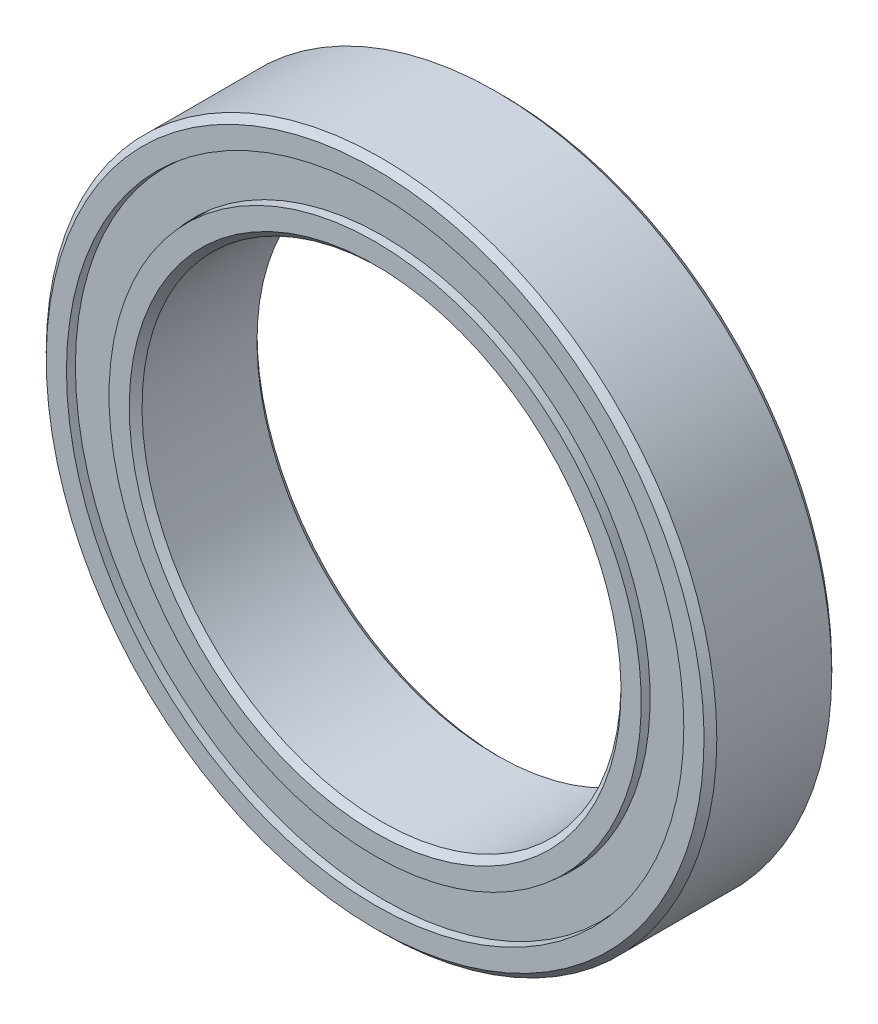
ISO-10303-21;
HEADER;
FILE_DESCRIPTION(('STEP AP214'),'2;1');
FILE_NAME('part.step','',(''),(''),'','','');
FILE_SCHEMA(('AUTOMOTIVE_DESIGN { 1 0 10303 214 1 1 1 1 }'));
ENDSEC;
DATA;
#1=APPLICATION_CONTEXT('core data for automotive mechanical design processes');
#2=APPLICATION_PROTOCOL_DEFINITION('international standard','automotive_design',2000,#1);
#3=PRODUCT_CONTEXT('',#1,'mechanical');
#4=PRODUCT('Part','Part','',(#3));
#5=PRODUCT_RELATED_PRODUCT_CATEGORY('part','',(#4));
#6=PRODUCT_DEFINITION_FORMATION('','',#4);
#7=PRODUCT_DEFINITION_CONTEXT('part definition',#1,'design');
#8=PRODUCT_DEFINITION('design','',#6,#7);
#9=PRODUCT_DEFINITION_SHAPE('','',#8);
#10=(LENGTH_UNIT() NAMED_UNIT(*) SI_UNIT(.MILLI.,.METRE.));
#11=(NAMED_UNIT(*) PLANE_ANGLE_UNIT() SI_UNIT($,.RADIAN.));
#12=(NAMED_UNIT(*) SI_UNIT($,.STERADIAN.) SOLID_ANGLE_UNIT());
#13=UNCERTAINTY_MEASURE_WITH_UNIT(LENGTH_MEASURE(1.E-05),#10,'distance_accuracy_value','');
#14=(GEOMETRIC_REPRESENTATION_CONTEXT(3) GLOBAL_UNCERTAINTY_ASSIGNED_CONTEXT((#13)) GLOBAL_UNIT_ASSIGNED_CONTEXT((#10,
#11,#12)) REPRESENTATION_CONTEXT('',''));
#15=CARTESIAN_POINT('',(0.,0.,0.));
#16=DIRECTION('',(0.,0.,1.));
#17=DIRECTION('',(1.,0.,0.));
#18=AXIS2_PLACEMENT_3D('',#15,#16,#17);
#19=CARTESIAN_POINT('',(3.90495365205792,8.10871981112182,0.));
#20=DIRECTION('',(0.,0.,1.));
#21=DIRECTION('',(0.433883739117546,0.900968867902425,0.));
#22=AXIS2_PLACEMENT_3D('',#19,#20,#21);
#23=SPHERICAL_SURFACE('',#22,1.11111111111111);
#24=CARTESIAN_POINT('',(3.90495365205792,8.10871981112182,1.11111111111111));
#25=VERTEX_POINT('',#24);
#26=VERTEX_LOOP('',#25);
#27=FACE_BOUND('',#26,.T.);
#28=ADVANCED_FACE('F42',(#27),#23,.T.);
#29=CLOSED_SHELL('',(#28));
#30=MANIFOLD_SOLID_BREP('B2',#29);
#31=CARTESIAN_POINT('',(7.0364833422122,5.61140821672869,0.));
#32=DIRECTION('',(0.,0.,1.));
#33=DIRECTION('',(0.781831482468022,0.623489801858743,0.));
#34=AXIS2_PLACEMENT_3D('',#31,#32,#33);
#35=SPHERICAL_SURFACE('',#34,1.11111111111111);
#36=CARTESIAN_POINT('',(7.0364833422122,5.61140821672869,1.11111111111111));
#37=VERTEX_POINT('',#36);
#38=VERTEX_LOOP('',#37);
#39=FACE_BOUND('',#38,.T.);
#40=ADVANCED_FACE('F63',(#39),#35,.T.);
#41=CLOSED_SHELL('',(#40));
#42=MANIFOLD_SOLID_BREP('B6',#41);
#43=CARTESIAN_POINT('',(8.77435120963639,2.00268840560692,0.));
#44=DIRECTION('',(0.,0.,1.));
#45=DIRECTION('',(0.974927912181821,0.222520933956325,0.));
#46=AXIS2_PLACEMENT_3D('',#43,#44,#45);
#47=SPHERICAL_SURFACE('',#46,1.11111111111111);
#48=CARTESIAN_POINT('',(8.77435120963639,2.00268840560692,1.11111111111111));
#49=VERTEX_POINT('',#48);
#50=VERTEX_LOOP('',#49);
#51=FACE_BOUND('',#50,.T.);
#52=ADVANCED_FACE('F84',(#51),#47,.T.);
#53=CLOSED_SHELL('',(#52));
#54=MANIFOLD_SOLID_BREP('B38',#53);
#55=CARTESIAN_POINT('',(8.77435120963643,-2.00268840560675,0.));
#56=DIRECTION('',(0.,0.,1.));
#57=DIRECTION('',(0.974927912181826,-0.222520933956305,0.));
#58=AXIS2_PLACEMENT_3D('',#55,#56,#57);
#59=SPHERICAL_SURFACE('',#58,1.11111111111111);
#60=CARTESIAN_POINT('',(8.77435120963643,-2.00268840560675,1.11111111111111));
#61=VERTEX_POINT('',#60);
#62=VERTEX_LOOP('',#61);
#63=FACE_BOUND('',#62,.T.);
#64=ADVANCED_FACE('F105',(#63),#59,.T.);
#65=CLOSED_SHELL('',(#64));
#66=MANIFOLD_SOLID_BREP('B59',#65);
#67=CARTESIAN_POINT('',(7.03648334221232,-5.61140821672854,0.));
#68=DIRECTION('',(0.,0.,1.));
#69=DIRECTION('',(0.781831482468035,-0.623489801858727,0.));
#70=AXIS2_PLACEMENT_3D('',#67,#68,#69);
#71=SPHERICAL_SURFACE('',#70,1.11111111111111);
#72=CARTESIAN_POINT('',(7.03648334221232,-5.61140821672854,1.11111111111111));
#73=VERTEX_POINT('',#72);
#74=VERTEX_LOOP('',#73);
#75=FACE_BOUND('',#74,.T.);
#76=ADVANCED_FACE('F126',(#75),#71,.T.);
#77=CLOSED_SHELL('',(#76));
#78=MANIFOLD_SOLID_BREP('B80',#77);
#79=CARTESIAN_POINT('',(3.90495365205809,-8.10871981112174,0.));
#80=DIRECTION('',(0.,0.,1.));
#81=DIRECTION('',(0.433883739117565,-0.900968867902416,0.));
#82=AXIS2_PLACEMENT_3D('',#79,#80,#81);
#83=SPHERICAL_SURFACE('',#82,1.11111111111111);
#84=CARTESIAN_POINT('',(3.90495365205809,-8.10871981112174,1.11111111111111));
#85=VERTEX_POINT('',#84);
#86=VERTEX_LOOP('',#85);
#87=FACE_BOUND('',#86,.T.);
#88=ADVANCED_FACE('F147',(#87),#83,.T.);
#89=CLOSED_SHELL('',(#88));
#90=MANIFOLD_SOLID_BREP('B101',#89);
#91=CARTESIAN_POINT('',(0.,-9.,0.));
#92=DIRECTION('',(0.,0.,1.));
#93=DIRECTION('',(0.,-1.,0.));
#94=AXIS2_PLACEMENT_3D('',#91,#92,#93);
#95=SPHERICAL_SURFACE('',#94,1.11111111111111);
#96=CARTESIAN_POINT('',(0.,-9.,1.11111111111111));
#97=VERTEX_POINT('',#96);
#98=VERTEX_LOOP('',#97);
#99=FACE_BOUND('',#98,.T.);
#100=ADVANCED_FACE('F168',(#99),#95,.T.);
#101=CLOSED_SHELL('',(#100));
#102=MANIFOLD_SOLID_BREP('B122',#101);
#103=CARTESIAN_POINT('',(-3.90495365205797,-8.1087198111218,0.));
#104=DIRECTION('',(0.,0.,1.));
#105=DIRECTION('',(-0.433883739117553,-0.900968867902422,0.));
#106=AXIS2_PLACEMENT_3D('',#103,#104,#105);
#107=SPHERICAL_SURFACE('',#106,1.11111111111111);
#108=CARTESIAN_POINT('',(-3.90495365205797,-8.1087198111218,1.11111111111111));
#109=VERTEX_POINT('',#108);
#110=VERTEX_LOOP('',#109);
#111=FACE_BOUND('',#110,.T.);
#112=ADVANCED_FACE('F189',(#111),#107,.T.);
#113=CLOSED_SHELL('',(#112));
#114=MANIFOLD_SOLID_BREP('B143',#113);
#115=CARTESIAN_POINT('',(-7.03648334221224,-5.61140821672864,0.));
#116=DIRECTION('',(0.,0.,1.));
#117=DIRECTION('',(-0.781831482468027,-0.623489801858737,0.));
#118=AXIS2_PLACEMENT_3D('',#115,#116,#117);
#119=SPHERICAL_SURFACE('',#118,1.11111111111111);
#120=CARTESIAN_POINT('',(-7.03648334221224,-5.61140821672864,1.11111111111111));
#121=VERTEX_POINT('',#120);
#122=VERTEX_LOOP('',#121);
#123=FACE_BOUND('',#122,.T.);
#124=ADVANCED_FACE('F210',(#123),#119,.T.);
#125=CLOSED_SHELL('',(#124));
#126=MANIFOLD_SOLID_BREP('B164',#125);
#127=CARTESIAN_POINT('',(-8.77435120963641,-2.00268840560686,0.));
#128=DIRECTION('',(0.,0.,1.));
#129=DIRECTION('',(-0.974927912181823,-0.222520933956318,0.));
#130=AXIS2_PLACEMENT_3D('',#127,#128,#129);
#131=SPHERICAL_SURFACE('',#130,1.11111111111111);
#132=CARTESIAN_POINT('',(-8.77435120963641,-2.00268840560686,1.11111111111111));
#133=VERTEX_POINT('',#132);
#134=VERTEX_LOOP('',#133);
#135=FACE_BOUND('',#134,.T.);
#136=ADVANCED_FACE('F231',(#135),#131,.T.);
#137=CLOSED_SHELL('',(#136));
#138=MANIFOLD_SOLID_BREP('B185',#137);
#139=CARTESIAN_POINT('',(-8.77435120963642,2.0026884056068,0.));
#140=DIRECTION('',(0.,0.,1.));
#141=DIRECTION('',(-0.974927912181824,0.222520933956311,0.));
#142=AXIS2_PLACEMENT_3D('',#139,#140,#141);
#143=SPHERICAL_SURFACE('',#142,1.11111111111111);
#144=CARTESIAN_POINT('',(-8.77435120963642,2.0026884056068,1.11111111111111));
#145=VERTEX_POINT('',#144);
#146=VERTEX_LOOP('',#145);
#147=FACE_BOUND('',#146,.T.);
#148=ADVANCED_FACE('F252',(#147),#143,.T.);
#149=CLOSED_SHELL('',(#148));
#150=MANIFOLD_SOLID_BREP('B206',#149);
#151=CARTESIAN_POINT('',(-7.03648334221228,5.61140821672859,0.));
#152=DIRECTION('',(0.,0.,1.));
#153=DIRECTION('',(-0.781831482468031,0.623489801858732,0.));
#154=AXIS2_PLACEMENT_3D('',#151,#152,#153);
#155=SPHERICAL_SURFACE('',#154,1.11111111111111);
#156=CARTESIAN_POINT('',(-7.03648334221228,5.61140821672859,1.11111111111111));
#157=VERTEX_POINT('',#156);
#158=VERTEX_LOOP('',#157);
#159=FACE_BOUND('',#158,.T.);
#160=ADVANCED_FACE('F273',(#159),#155,.T.);
#161=CLOSED_SHELL('',(#160));
#162=MANIFOLD_SOLID_BREP('B227',#161);
#163=CARTESIAN_POINT('',(-3.90495365205803,8.10871981112177,0.));
#164=DIRECTION('',(0.,0.,1.));
#165=DIRECTION('',(-0.433883739117559,0.900968867902419,0.));
#166=AXIS2_PLACEMENT_3D('',#163,#164,#165);
#167=SPHERICAL_SURFACE('',#166,1.11111111111111);
#168=CARTESIAN_POINT('',(-3.90495365205803,8.10871981112177,1.11111111111111));
#169=VERTEX_POINT('',#168);
#170=VERTEX_LOOP('',#169);
#171=FACE_BOUND('',#170,.T.);
#172=ADVANCED_FACE('F294',(#171),#167,.T.);
#173=CLOSED_SHELL('',(#172));
#174=MANIFOLD_SOLID_BREP('B248',#173);
#175=CARTESIAN_POINT('',(0.,9.,0.));
#176=DIRECTION('',(0.,0.,1.));
#177=DIRECTION('',(0.,1.,0.));
#178=AXIS2_PLACEMENT_3D('',#175,#176,#177);
#179=SPHERICAL_SURFACE('',#178,1.11111111111111);
#180=CARTESIAN_POINT('',(0.,9.,1.11111111111111));
#181=VERTEX_POINT('',#180);
#182=VERTEX_LOOP('',#181);
#183=FACE_BOUND('',#182,.T.);
#184=ADVANCED_FACE('F317',(#183),#179,.T.);
#185=CLOSED_SHELL('',(#184));
#186=MANIFOLD_SOLID_BREP('B269',#185);
#187=CARTESIAN_POINT('',(0.,8.33333333333333,2.00000000000002));
#188=DIRECTION('',(0.,0.,-1.));
#189=DIRECTION('',(0.,1.,0.));
#190=AXIS2_PLACEMENT_3D('',#187,#188,#189);
#191=PLANE('',#190);
#192=CARTESIAN_POINT('',(0.,0.,2.00000000000002));
#193=DIRECTION('',(0.,0.,1.));
#194=DIRECTION('',(0.,-1.,0.));
#195=AXIS2_PLACEMENT_3D('',#192,#193,#194);
#196=CIRCLE('',#195,7.7);
#197=CARTESIAN_POINT('',(0.,-7.7,2.00000000000001));
#198=VERTEX_POINT('',#197);
#199=EDGE_CURVE('E366',#198,#198,#196,.T.);
#200=ORIENTED_EDGE('',*,*,#199,.F.);
#201=EDGE_LOOP('',(#200));
#202=FACE_BOUND('',#201,.T.);
#203=CARTESIAN_POINT('',(0.,0.,2.00000000000002));
#204=DIRECTION('',(0.,0.,1.));
#205=DIRECTION('',(0.,-1.,0.));
#206=AXIS2_PLACEMENT_3D('',#203,#204,#205);
#207=CIRCLE('',#206,8.33333333333333);
#208=CARTESIAN_POINT('',(0.,-8.33333333333333,2.00000000000001));
#209=VERTEX_POINT('',#208);
#210=EDGE_CURVE('E316',#209,#209,#207,.T.);
#211=ORIENTED_EDGE('',*,*,#210,.T.);
#212=EDGE_LOOP('',(#211));
#213=FACE_BOUND('',#212,.T.);
#214=ADVANCED_FACE('F338',(#202,#213),#191,.F.);
#215=CARTESIAN_POINT('',(0.,0.,2.00000000000001));
#216=DIRECTION('',(0.,0.,1.));
#217=DIRECTION('',(0.,-1.,0.));
#218=AXIS2_PLACEMENT_3D('',#215,#216,#217);
#219=CYLINDRICAL_SURFACE('',#218,8.33333333333333);
#220=ORIENTED_EDGE('',*,*,#210,.F.);
#221=EDGE_LOOP('',(#220));
#222=FACE_BOUND('',#221,.T.);
#223=CARTESIAN_POINT('',(0.,0.,0.888888888888885));
#224=DIRECTION('',(0.,0.,1.));
#225=DIRECTION('',(0.,-1.,0.));
#226=AXIS2_PLACEMENT_3D('',#223,#224,#225);
#227=CIRCLE('',#226,8.33333333333333);
#228=CARTESIAN_POINT('',(0.,-8.33333333333333,0.888888888888884));
#229=VERTEX_POINT('',#228);
#230=EDGE_CURVE('E344',#229,#229,#227,.T.);
#231=ORIENTED_EDGE('',*,*,#230,.T.);
#232=EDGE_LOOP('',(#231));
#233=FACE_BOUND('',#232,.T.);
#234=ADVANCED_FACE('F373',(#222,#233),#219,.T.);
#235=CARTESIAN_POINT('',(0.,0.,0.));
#236=DIRECTION('',(0.,0.,1.));
#237=DIRECTION('',(0.,-1.,0.));
#238=AXIS2_PLACEMENT_3D('',#235,#236,#237);
#239=TOROIDAL_SURFACE('',#238,9.00000000000001,1.11111111111111);
#240=ORIENTED_EDGE('',*,*,#230,.F.);
#241=EDGE_LOOP('',(#240));
#242=FACE_BOUND('',#241,.T.);
#243=CARTESIAN_POINT('',(0.,0.,-0.888888888888887));
#244=DIRECTION('',(0.,0.,1.));
#245=DIRECTION('',(0.,-1.,0.));
#246=AXIS2_PLACEMENT_3D('',#243,#244,#245);
#247=CIRCLE('',#246,8.33333333333333);
#248=CARTESIAN_POINT('',(0.,-8.33333333333333,-0.888888888888888));
#249=VERTEX_POINT('',#248);
#250=EDGE_CURVE('E348',#249,#249,#247,.T.);
#251=ORIENTED_EDGE('',*,*,#250,.T.);
#252=EDGE_LOOP('',(#251));
#253=FACE_BOUND('',#252,.T.);
#254=ADVANCED_FACE('F377',(#242,#253),#239,.F.);
#255=CARTESIAN_POINT('',(0.,0.,2.00000000000001));
#256=DIRECTION('',(0.,0.,1.));
#257=DIRECTION('',(0.,-1.,0.));
#258=AXIS2_PLACEMENT_3D('',#255,#256,#257);
#259=CYLINDRICAL_SURFACE('',#258,8.33333333333333);
#260=ORIENTED_EDGE('',*,*,#250,.F.);
#261=EDGE_LOOP('',(#260));
#262=FACE_BOUND('',#261,.T.);
#263=CARTESIAN_POINT('',(0.,0.,-2.00000000000002));
#264=DIRECTION('',(0.,0.,1.));
#265=DIRECTION('',(0.,-1.,0.));
#266=AXIS2_PLACEMENT_3D('',#263,#264,#265);
#267=CIRCLE('',#266,8.33333333333333);
#268=CARTESIAN_POINT('',(0.,-8.33333333333333,-2.00000000000002));
#269=VERTEX_POINT('',#268);
#270=EDGE_CURVE('E352',#269,#269,#267,.T.);
#271=ORIENTED_EDGE('',*,*,#270,.T.);
#272=EDGE_LOOP('',(#271));
#273=FACE_BOUND('',#272,.T.);
#274=ADVANCED_FACE('F382',(#262,#273),#259,.T.);
#275=CARTESIAN_POINT('',(0.,7.70000000000001,-2.00000000000002));
#276=DIRECTION('',(0.,0.,1.));
#277=DIRECTION('',(0.,-1.,0.));
#278=AXIS2_PLACEMENT_3D('',#275,#276,#277);
#279=PLANE('',#278);
#280=ORIENTED_EDGE('',*,*,#270,.F.);
#281=EDGE_LOOP('',(#280));
#282=FACE_BOUND('',#281,.T.);
#283=CARTESIAN_POINT('',(0.,0.,-2.00000000000002));
#284=DIRECTION('',(0.,0.,1.));
#285=DIRECTION('',(0.,-1.,0.));
#286=AXIS2_PLACEMENT_3D('',#283,#284,#285);
#287=CIRCLE('',#286,7.7);
#288=CARTESIAN_POINT('',(0.,-7.7,-2.00000000000002));
#289=VERTEX_POINT('',#288);
#290=EDGE_CURVE('E357',#289,#289,#287,.T.);
#291=ORIENTED_EDGE('',*,*,#290,.T.);
#292=EDGE_LOOP('',(#291));
#293=FACE_BOUND('',#292,.T.);
#294=ADVANCED_FACE('F388',(#282,#293),#279,.F.);
#295=CARTESIAN_POINT('',(0.,0.,-1.80000000000002));
#296=DIRECTION('',(0.,0.,-1.));
#297=DIRECTION('',(0.,1.,0.));
#298=AXIS2_PLACEMENT_3D('',#295,#296,#297);
#299=CONICAL_SURFACE('',#298,7.5,0.785398163397458);
#300=ORIENTED_EDGE('',*,*,#290,.F.);
#301=EDGE_LOOP('',(#300));
#302=FACE_BOUND('',#301,.T.);
#303=CARTESIAN_POINT('',(0.,0.,-1.80000000000002));
#304=DIRECTION('',(0.,0.,1.));
#305=DIRECTION('',(0.,-1.,0.));
#306=AXIS2_PLACEMENT_3D('',#303,#304,#305);
#307=CIRCLE('',#306,7.5);
#308=CARTESIAN_POINT('',(0.,-7.5,-1.80000000000002));
#309=VERTEX_POINT('',#308);
#310=EDGE_CURVE('E360',#309,#309,#307,.T.);
#311=ORIENTED_EDGE('',*,*,#310,.T.);
#312=EDGE_LOOP('',(#311));
#313=FACE_BOUND('',#312,.T.);
#314=ADVANCED_FACE('F392',(#302,#313),#299,.F.);
#315=CARTESIAN_POINT('',(0.,0.,2.00000000000001));
#316=DIRECTION('',(0.,0.,1.));
#317=DIRECTION('',(0.,-1.,0.));
#318=AXIS2_PLACEMENT_3D('',#315,#316,#317);
#319=CYLINDRICAL_SURFACE('',#318,7.5);
#320=ORIENTED_EDGE('',*,*,#310,.F.);
#321=EDGE_LOOP('',(#320));
#322=FACE_BOUND('',#321,.T.);
#323=CARTESIAN_POINT('',(0.,0.,1.80000000000001));
#324=DIRECTION('',(0.,0.,1.));
#325=DIRECTION('',(0.,-1.,0.));
#326=AXIS2_PLACEMENT_3D('',#323,#324,#325);
#327=CIRCLE('',#326,7.5);
#328=CARTESIAN_POINT('',(0.,-7.5,1.80000000000001));
#329=VERTEX_POINT('',#328);
#330=EDGE_CURVE('E363',#329,#329,#327,.T.);
#331=ORIENTED_EDGE('',*,*,#330,.T.);
#332=EDGE_LOOP('',(#331));
#333=FACE_BOUND('',#332,.T.);
#334=ADVANCED_FACE('F396',(#322,#333),#319,.F.);
#335=CARTESIAN_POINT('',(0.,0.,2.00000000000002));
#336=DIRECTION('',(0.,0.,1.));
#337=DIRECTION('',(0.,-1.,0.));
#338=AXIS2_PLACEMENT_3D('',#335,#336,#337);
#339=CONICAL_SURFACE('',#338,7.7,0.785398163397444);
#340=ORIENTED_EDGE('',*,*,#330,.F.);
#341=EDGE_LOOP('',(#340));
#342=FACE_BOUND('',#341,.T.);
#343=ORIENTED_EDGE('',*,*,#199,.T.);
#344=EDGE_LOOP('',(#343));
#345=FACE_BOUND('',#344,.T.);
#346=ADVANCED_FACE('F370',(#342,#345),#339,.F.);
#347=CLOSED_SHELL('',(#214,#234,#254,#274,#294,#314,#334,#346));
#348=MANIFOLD_SOLID_BREP('B290',#347);
#349=CARTESIAN_POINT('',(0.,8.35873333333334,-1.36505555555557));
#350=DIRECTION('',(0.,0.,-1.));
#351=DIRECTION('',(0.,1.,0.));
#352=AXIS2_PLACEMENT_3D('',#349,#350,#351);
#353=PLANE('',#352);
#354=CARTESIAN_POINT('',(0.,0.,-1.36505555555557));
#355=DIRECTION('',(0.,0.,1.));
#356=DIRECTION('',(0.,-1.,0.));
#357=AXIS2_PLACEMENT_3D('',#354,#355,#356);
#358=CIRCLE('',#357,8.35873333333334);
#359=CARTESIAN_POINT('',(0.,-8.35873333333334,-1.36505555555557));
#360=VERTEX_POINT('',#359);
#361=EDGE_CURVE('E482',#360,#360,#358,.T.);
#362=ORIENTED_EDGE('',*,*,#361,.F.);
#363=EDGE_LOOP('',(#362));
#364=FACE_BOUND('',#363,.T.);
#365=CARTESIAN_POINT('',(0.,0.,-1.36505555555557));
#366=DIRECTION('',(0.,0.,1.));
#367=DIRECTION('',(0.,-1.,0.));
#368=AXIS2_PLACEMENT_3D('',#365,#366,#367);
#369=CIRCLE('',#368,9.64126666666667);
#370=CARTESIAN_POINT('',(0.,-9.64126666666667,-1.36505555555557));
#371=VERTEX_POINT('',#370);
#372=EDGE_CURVE('E337',#371,#371,#369,.T.);
#373=ORIENTED_EDGE('',*,*,#372,.T.);
#374=EDGE_LOOP('',(#373));
#375=FACE_BOUND('',#374,.T.);
#376=ADVANCED_FACE('F468',(#364,#375),#353,.F.);
#377=CARTESIAN_POINT('',(0.,0.,2.00000000000001));
#378=DIRECTION('',(0.,0.,1.));
#379=DIRECTION('',(0.,-1.,0.));
#380=AXIS2_PLACEMENT_3D('',#377,#378,#379);
#381=CYLINDRICAL_SURFACE('',#380,9.64126666666667);
#382=ORIENTED_EDGE('',*,*,#372,.F.);
#383=EDGE_LOOP('',(#382));
#384=FACE_BOUND('',#383,.T.);
#385=CARTESIAN_POINT('',(0.,0.,-1.74605555555557));
#386=DIRECTION('',(0.,0.,1.));
#387=DIRECTION('',(0.,-1.,0.));
#388=AXIS2_PLACEMENT_3D('',#385,#386,#387);
#389=CIRCLE('',#388,9.64126666666667);
#390=CARTESIAN_POINT('',(0.,-9.64126666666667,-1.74605555555557));
#391=VERTEX_POINT('',#390);
#392=EDGE_CURVE('E474',#391,#391,#389,.T.);
#393=ORIENTED_EDGE('',*,*,#392,.T.);
#394=EDGE_LOOP('',(#393));
#395=FACE_BOUND('',#394,.T.);
#396=ADVANCED_FACE('F491',(#384,#395),#381,.T.);
#397=CARTESIAN_POINT('',(0.,8.35873333333334,-1.74605555555557));
#398=DIRECTION('',(0.,0.,1.));
#399=DIRECTION('',(0.,-1.,0.));
#400=AXIS2_PLACEMENT_3D('',#397,#398,#399);
#401=PLANE('',#400);
#402=ORIENTED_EDGE('',*,*,#392,.F.);
#403=EDGE_LOOP('',(#402));
#404=FACE_BOUND('',#403,.T.);
#405=CARTESIAN_POINT('',(0.,0.,-1.74605555555557));
#406=DIRECTION('',(0.,0.,1.));
#407=DIRECTION('',(0.,-1.,0.));
#408=AXIS2_PLACEMENT_3D('',#405,#406,#407);
#409=CIRCLE('',#408,8.35873333333334);
#410=CARTESIAN_POINT('',(0.,-8.35873333333334,-1.74605555555557));
#411=VERTEX_POINT('',#410);
#412=EDGE_CURVE('E478',#411,#411,#409,.T.);
#413=ORIENTED_EDGE('',*,*,#412,.T.);
#414=EDGE_LOOP('',(#413));
#415=FACE_BOUND('',#414,.T.);
#416=ADVANCED_FACE('F495',(#404,#415),#401,.F.);
#417=CARTESIAN_POINT('',(0.,0.,2.00000000000001));
#418=DIRECTION('',(0.,0.,1.));
#419=DIRECTION('',(0.,-1.,0.));
#420=AXIS2_PLACEMENT_3D('',#417,#418,#419);
#421=CYLINDRICAL_SURFACE('',#420,8.35873333333334);
#422=ORIENTED_EDGE('',*,*,#412,.F.);
#423=EDGE_LOOP('',(#422));
#424=FACE_BOUND('',#423,.T.);
#425=ORIENTED_EDGE('',*,*,#361,.T.);
#426=EDGE_LOOP('',(#425));
#427=FACE_BOUND('',#426,.T.);
#428=ADVANCED_FACE('F488',(#424,#427),#421,.F.);
#429=CLOSED_SHELL('',(#376,#396,#416,#428));
#430=MANIFOLD_SOLID_BREP('B311',#429);
#431=CARTESIAN_POINT('',(0.,8.35873333333334,1.74605555555556));
#432=DIRECTION('',(0.,0.,-1.));
#433=DIRECTION('',(0.,1.,0.));
#434=AXIS2_PLACEMENT_3D('',#431,#432,#433);
#435=PLANE('',#434);
#436=CARTESIAN_POINT('',(0.,0.,1.74605555555556));
#437=DIRECTION('',(0.,0.,1.));
#438=DIRECTION('',(0.,-1.,0.));
#439=AXIS2_PLACEMENT_3D('',#436,#437,#438);
#440=CIRCLE('',#439,8.35873333333334);
#441=CARTESIAN_POINT('',(0.,-8.35873333333334,1.74605555555556));
#442=VERTEX_POINT('',#441);
#443=EDGE_CURVE('E467',#442,#442,#440,.T.);
#444=ORIENTED_EDGE('',*,*,#443,.F.);
#445=EDGE_LOOP('',(#444));
#446=FACE_BOUND('',#445,.T.);
#447=CARTESIAN_POINT('',(0.,0.,1.74605555555556));
#448=DIRECTION('',(0.,0.,1.));
#449=DIRECTION('',(0.,-1.,0.));
#450=AXIS2_PLACEMENT_3D('',#447,#448,#449);
#451=CIRCLE('',#450,9.64126666666667);
#452=CARTESIAN_POINT('',(0.,-9.64126666666667,1.74605555555556));
#453=VERTEX_POINT('',#452);
#454=EDGE_CURVE('E551',#453,#453,#451,.T.);
#455=ORIENTED_EDGE('',*,*,#454,.T.);
#456=EDGE_LOOP('',(#455));
#457=FACE_BOUND('',#456,.T.);
#458=ADVANCED_FACE('F537',(#446,#457),#435,.F.);
#459=CARTESIAN_POINT('',(0.,0.,2.00000000000001));
#460=DIRECTION('',(0.,0.,1.));
#461=DIRECTION('',(0.,-1.,0.));
#462=AXIS2_PLACEMENT_3D('',#459,#460,#461);
#463=CYLINDRICAL_SURFACE('',#462,8.35873333333334);
#464=CARTESIAN_POINT('',(0.,0.,1.36505555555556));
#465=DIRECTION('',(0.,0.,1.));
#466=DIRECTION('',(0.,-1.,0.));
#467=AXIS2_PLACEMENT_3D('',#464,#465,#466);
#468=CIRCLE('',#467,8.35873333333334);
#469=CARTESIAN_POINT('',(0.,-8.35873333333334,1.36505555555556));
#470=VERTEX_POINT('',#469);
#471=EDGE_CURVE('E543',#470,#470,#468,.T.);
#472=ORIENTED_EDGE('',*,*,#471,.F.);
#473=EDGE_LOOP('',(#472));
#474=FACE_BOUND('',#473,.T.);
#475=ORIENTED_EDGE('',*,*,#443,.T.);
#476=EDGE_LOOP('',(#475));
#477=FACE_BOUND('',#476,.T.);
#478=ADVANCED_FACE('F566',(#474,#477),#463,.F.);
#479=CARTESIAN_POINT('',(0.,8.35873333333334,1.36505555555556));
#480=DIRECTION('',(0.,0.,1.));
#481=DIRECTION('',(0.,-1.,0.));
#482=AXIS2_PLACEMENT_3D('',#479,#480,#481);
#483=PLANE('',#482);
#484=CARTESIAN_POINT('',(0.,0.,1.36505555555556));
#485=DIRECTION('',(0.,0.,1.));
#486=DIRECTION('',(0.,-1.,0.));
#487=AXIS2_PLACEMENT_3D('',#484,#485,#486);
#488=CIRCLE('',#487,9.64126666666667);
#489=CARTESIAN_POINT('',(0.,-9.64126666666667,1.36505555555556));
#490=VERTEX_POINT('',#489);
#491=EDGE_CURVE('E547',#490,#490,#488,.T.);
#492=ORIENTED_EDGE('',*,*,#491,.F.);
#493=EDGE_LOOP('',(#492));
#494=FACE_BOUND('',#493,.T.);
#495=ORIENTED_EDGE('',*,*,#471,.T.);
#496=EDGE_LOOP('',(#495));
#497=FACE_BOUND('',#496,.T.);
#498=ADVANCED_FACE('F561',(#494,#497),#483,.F.);
#499=CARTESIAN_POINT('',(0.,0.,2.00000000000001));
#500=DIRECTION('',(0.,0.,1.));
#501=DIRECTION('',(0.,-1.,0.));
#502=AXIS2_PLACEMENT_3D('',#499,#500,#501);
#503=CYLINDRICAL_SURFACE('',#502,9.64126666666667);
#504=ORIENTED_EDGE('',*,*,#454,.F.);
#505=EDGE_LOOP('',(#504));
#506=FACE_BOUND('',#505,.T.);
#507=ORIENTED_EDGE('',*,*,#491,.T.);
#508=EDGE_LOOP('',(#507));
#509=FACE_BOUND('',#508,.T.);
#510=ADVANCED_FACE('F558',(#506,#509),#503,.T.);
#511=CLOSED_SHELL('',(#458,#478,#498,#510));
#512=MANIFOLD_SOLID_BREP('B332',#511);
#513=CARTESIAN_POINT('',(0.,0.,1.80000000000001));
#514=DIRECTION('',(0.,0.,-1.));
#515=DIRECTION('',(0.,1.,0.));
#516=AXIS2_PLACEMENT_3D('',#513,#514,#515);
#517=CONICAL_SURFACE('',#516,10.5,0.785398163397462);
#518=CARTESIAN_POINT('',(0.,0.,2.00000000000001));
#519=DIRECTION('',(0.,0.,1.));
#520=DIRECTION('',(0.,-1.,0.));
#521=AXIS2_PLACEMENT_3D('',#518,#519,#520);
#522=CIRCLE('',#521,10.3);
#523=CARTESIAN_POINT('',(0.,-10.3,2.00000000000001));
#524=VERTEX_POINT('',#523);
#525=EDGE_CURVE('E627',#524,#524,#522,.T.);
#526=ORIENTED_EDGE('',*,*,#525,.F.);
#527=EDGE_LOOP('',(#526));
#528=FACE_BOUND('',#527,.T.);
#529=CARTESIAN_POINT('',(0.,0.,1.80000000000001));
#530=DIRECTION('',(0.,0.,1.));
#531=DIRECTION('',(0.,-1.,0.));
#532=AXIS2_PLACEMENT_3D('',#529,#530,#531);
#533=CIRCLE('',#532,10.5);
#534=CARTESIAN_POINT('',(0.,-10.5,1.80000000000001));
#535=VERTEX_POINT('',#534);
#536=EDGE_CURVE('E536',#535,#535,#533,.T.);
#537=ORIENTED_EDGE('',*,*,#536,.T.);
#538=EDGE_LOOP('',(#537));
#539=FACE_BOUND('',#538,.T.);
#540=ADVANCED_FACE('F599',(#528,#539),#517,.T.);
#541=CARTESIAN_POINT('',(0.,0.,2.00000000000001));
#542=DIRECTION('',(0.,0.,1.));
#543=DIRECTION('',(0.,-1.,0.));
#544=AXIS2_PLACEMENT_3D('',#541,#542,#543);
#545=CYLINDRICAL_SURFACE('',#544,10.5);
#546=ORIENTED_EDGE('',*,*,#536,.F.);
#547=EDGE_LOOP('',(#546));
#548=FACE_BOUND('',#547,.T.);
#549=CARTESIAN_POINT('',(0.,0.,-1.80000000000002));
#550=DIRECTION('',(0.,0.,1.));
#551=DIRECTION('',(0.,-1.,0.));
#552=AXIS2_PLACEMENT_3D('',#549,#550,#551);
#553=CIRCLE('',#552,10.5);
#554=CARTESIAN_POINT('',(0.,-10.5,-1.80000000000002));
#555=VERTEX_POINT('',#554);
#556=EDGE_CURVE('E605',#555,#555,#553,.T.);
#557=ORIENTED_EDGE('',*,*,#556,.T.);
#558=EDGE_LOOP('',(#557));
#559=FACE_BOUND('',#558,.T.);
#560=ADVANCED_FACE('F634',(#548,#559),#545,.T.);
#561=CARTESIAN_POINT('',(0.,0.,-2.00000000000002));
#562=DIRECTION('',(0.,0.,1.));
#563=DIRECTION('',(0.,-1.,0.));
#564=AXIS2_PLACEMENT_3D('',#561,#562,#563);
#565=CONICAL_SURFACE('',#564,10.3,0.785398163397463);
#566=ORIENTED_EDGE('',*,*,#556,.F.);
#567=EDGE_LOOP('',(#566));
#568=FACE_BOUND('',#567,.T.);
#569=CARTESIAN_POINT('',(0.,0.,-2.00000000000002));
#570=DIRECTION('',(0.,0.,1.));
#571=DIRECTION('',(0.,-1.,0.));
#572=AXIS2_PLACEMENT_3D('',#569,#570,#571);
#573=CIRCLE('',#572,10.3);
#574=CARTESIAN_POINT('',(0.,-10.3,-2.00000000000002));
#575=VERTEX_POINT('',#574);
#576=EDGE_CURVE('E609',#575,#575,#573,.T.);
#577=ORIENTED_EDGE('',*,*,#576,.T.);
#578=EDGE_LOOP('',(#577));
#579=FACE_BOUND('',#578,.T.);
#580=ADVANCED_FACE('F638',(#568,#579),#565,.T.);
#581=CARTESIAN_POINT('',(0.,10.3,-2.00000000000002));
#582=DIRECTION('',(0.,0.,1.));
#583=DIRECTION('',(0.,-1.,0.));
#584=AXIS2_PLACEMENT_3D('',#581,#582,#583);
#585=PLANE('',#584);
#586=ORIENTED_EDGE('',*,*,#576,.F.);
#587=EDGE_LOOP('',(#586));
#588=FACE_BOUND('',#587,.T.);
#589=CARTESIAN_POINT('',(0.,0.,-2.00000000000002));
#590=DIRECTION('',(0.,0.,1.));
#591=DIRECTION('',(0.,-1.,0.));
#592=AXIS2_PLACEMENT_3D('',#589,#590,#591);
#593=CIRCLE('',#592,9.66666666666667);
#594=CARTESIAN_POINT('',(0.,-9.66666666666667,-2.00000000000002));
#595=VERTEX_POINT('',#594);
#596=EDGE_CURVE('E613',#595,#595,#593,.T.);
#597=ORIENTED_EDGE('',*,*,#596,.T.);
#598=EDGE_LOOP('',(#597));
#599=FACE_BOUND('',#598,.T.);
#600=ADVANCED_FACE('F643',(#588,#599),#585,.F.);
#601=CARTESIAN_POINT('',(0.,0.,2.00000000000001));
#602=DIRECTION('',(0.,0.,1.));
#603=DIRECTION('',(0.,-1.,0.));
#604=AXIS2_PLACEMENT_3D('',#601,#602,#603);
#605=CYLINDRICAL_SURFACE('',#604,9.66666666666667);
#606=ORIENTED_EDGE('',*,*,#596,.F.);
#607=EDGE_LOOP('',(#606));
#608=FACE_BOUND('',#607,.T.);
#609=CARTESIAN_POINT('',(0.,0.,-0.888888888888894));
#610=DIRECTION('',(0.,0.,1.));
#611=DIRECTION('',(0.,-1.,0.));
#612=AXIS2_PLACEMENT_3D('',#609,#610,#611);
#613=CIRCLE('',#612,9.66666666666667);
#614=CARTESIAN_POINT('',(0.,-9.66666666666667,-0.888888888888895));
#615=VERTEX_POINT('',#614);
#616=EDGE_CURVE('E618',#615,#615,#613,.T.);
#617=ORIENTED_EDGE('',*,*,#616,.T.);
#618=EDGE_LOOP('',(#617));
#619=FACE_BOUND('',#618,.T.);
#620=ADVANCED_FACE('F649',(#608,#619),#605,.F.);
#621=CARTESIAN_POINT('',(0.,0.,0.));
#622=DIRECTION('',(0.,0.,1.));
#623=DIRECTION('',(0.,-1.,0.));
#624=AXIS2_PLACEMENT_3D('',#621,#622,#623);
#625=TOROIDAL_SURFACE('',#624,9.,1.11111111111111);
#626=ORIENTED_EDGE('',*,*,#616,.F.);
#627=EDGE_LOOP('',(#626));
#628=FACE_BOUND('',#627,.T.);
#629=CARTESIAN_POINT('',(0.,0.,0.888888888888885));
#630=DIRECTION('',(0.,0.,1.));
#631=DIRECTION('',(0.,-1.,0.));
#632=AXIS2_PLACEMENT_3D('',#629,#630,#631);
#633=CIRCLE('',#632,9.66666666666667);
#634=CARTESIAN_POINT('',(0.,-9.66666666666667,0.888888888888883));
#635=VERTEX_POINT('',#634);
#636=EDGE_CURVE('E621',#635,#635,#633,.T.);
#637=ORIENTED_EDGE('',*,*,#636,.T.);
#638=EDGE_LOOP('',(#637));
#639=FACE_BOUND('',#638,.T.);
#640=ADVANCED_FACE('F653',(#628,#639),#625,.F.);
#641=CARTESIAN_POINT('',(0.,0.,2.00000000000001));
#642=DIRECTION('',(0.,0.,1.));
#643=DIRECTION('',(0.,-1.,0.));
#644=AXIS2_PLACEMENT_3D('',#641,#642,#643);
#645=CYLINDRICAL_SURFACE('',#644,9.66666666666667);
#646=ORIENTED_EDGE('',*,*,#636,.F.);
#647=EDGE_LOOP('',(#646));
#648=FACE_BOUND('',#647,.T.);
#649=CARTESIAN_POINT('',(0.,0.,2.00000000000001));
#650=DIRECTION('',(0.,0.,1.));
#651=DIRECTION('',(0.,-1.,0.));
#652=AXIS2_PLACEMENT_3D('',#649,#650,#651);
#653=CIRCLE('',#652,9.66666666666667);
#654=CARTESIAN_POINT('',(0.,-9.66666666666667,2.00000000000001));
#655=VERTEX_POINT('',#654);
#656=EDGE_CURVE('E624',#655,#655,#653,.T.);
#657=ORIENTED_EDGE('',*,*,#656,.T.);
#658=EDGE_LOOP('',(#657));
#659=FACE_BOUND('',#658,.T.);
#660=ADVANCED_FACE('F657',(#648,#659),#645,.F.);
#661=CARTESIAN_POINT('',(0.,10.3,2.00000000000001));
#662=DIRECTION('',(0.,0.,-1.));
#663=DIRECTION('',(0.,1.,0.));
#664=AXIS2_PLACEMENT_3D('',#661,#662,#663);
#665=PLANE('',#664);
#666=ORIENTED_EDGE('',*,*,#656,.F.);
#667=EDGE_LOOP('',(#666));
#668=FACE_BOUND('',#667,.T.);
#669=ORIENTED_EDGE('',*,*,#525,.T.);
#670=EDGE_LOOP('',(#669));
#671=FACE_BOUND('',#670,.T.);
#672=ADVANCED_FACE('F631',(#668,#671),#665,.F.);
#673=CLOSED_SHELL('',(#540,#560,#580,#600,#620,#640,#660,#672));
#674=MANIFOLD_SOLID_BREP('B462',#673);
#675=ADVANCED_BREP_SHAPE_REPRESENTATION('',(#18,#30,#42,#54,#66,#78,#90,#102,#114,#126,#138,
#150,#162,#174,#186,#348,#430,#512,#674),#14);
#676=SHAPE_DEFINITION_REPRESENTATION(#9,#675);
ENDSEC;
END-ISO-10303-21;
